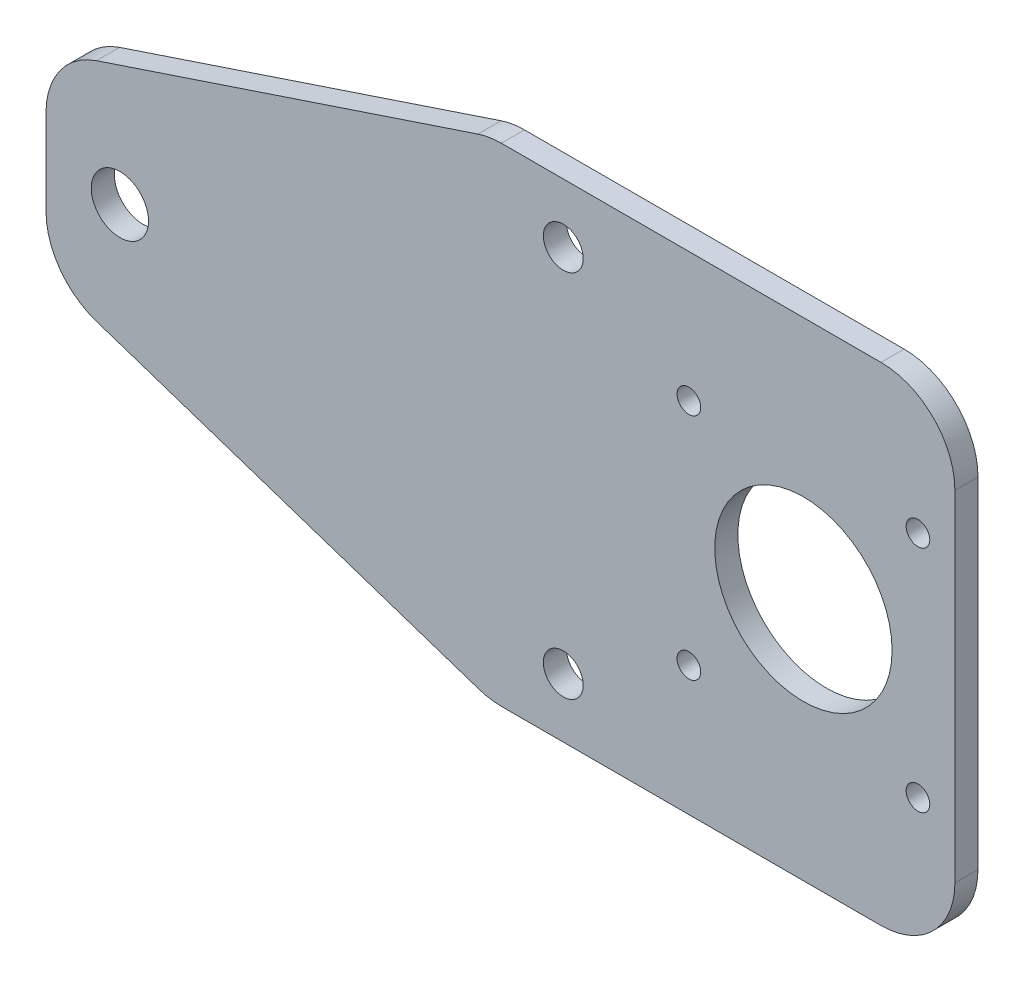
ISO-10303-21;
HEADER;
FILE_DESCRIPTION(('STEP AP214'),'2;1');
FILE_NAME('part.step','',(''),(''),'','','');
FILE_SCHEMA(('AUTOMOTIVE_DESIGN { 1 0 10303 214 1 1 1 1 }'));
ENDSEC;
DATA;
#1=APPLICATION_CONTEXT('core data for automotive mechanical design processes');
#2=APPLICATION_PROTOCOL_DEFINITION('international standard','automotive_design',2000,#1);
#3=PRODUCT_CONTEXT('',#1,'mechanical');
#4=PRODUCT('Part','Part','',(#3));
#5=PRODUCT_RELATED_PRODUCT_CATEGORY('part','',(#4));
#6=PRODUCT_DEFINITION_FORMATION('','',#4);
#7=PRODUCT_DEFINITION_CONTEXT('part definition',#1,'design');
#8=PRODUCT_DEFINITION('design','',#6,#7);
#9=PRODUCT_DEFINITION_SHAPE('','',#8);
#10=(LENGTH_UNIT() NAMED_UNIT(*) SI_UNIT(.MILLI.,.METRE.));
#11=(NAMED_UNIT(*) PLANE_ANGLE_UNIT() SI_UNIT($,.RADIAN.));
#12=(NAMED_UNIT(*) SI_UNIT($,.STERADIAN.) SOLID_ANGLE_UNIT());
#13=UNCERTAINTY_MEASURE_WITH_UNIT(LENGTH_MEASURE(1.E-05),#10,'distance_accuracy_value','');
#14=(GEOMETRIC_REPRESENTATION_CONTEXT(3) GLOBAL_UNCERTAINTY_ASSIGNED_CONTEXT((#13)) GLOBAL_UNIT_ASSIGNED_CONTEXT((#10,
#11,#12)) REPRESENTATION_CONTEXT('',''));
#15=CARTESIAN_POINT('',(0.,0.,0.));
#16=DIRECTION('',(0.,0.,1.));
#17=DIRECTION('',(1.,0.,0.));
#18=AXIS2_PLACEMENT_3D('',#15,#16,#17);
#19=CARTESIAN_POINT('',(0.,0.,3.125));
#20=DIRECTION('',(0.,0.,-1.));
#21=DIRECTION('',(-1.,0.,0.));
#22=AXIS2_PLACEMENT_3D('',#19,#20,#21);
#23=PLANE('',#22);
#24=CARTESIAN_POINT('',(86.9364751647332,17.5000000000003,3.125));
#25=DIRECTION('',(0.,0.,1.));
#26=DIRECTION('',(1.,0.,0.));
#27=AXIS2_PLACEMENT_3D('',#24,#25,#26);
#28=CIRCLE('',#27,1.59999999999999);
#29=CARTESIAN_POINT('',(88.5364751647331,17.5000000000003,3.125));
#30=VERTEX_POINT('',#29);
#31=EDGE_CURVE('E463',#30,#30,#28,.T.);
#32=ORIENTED_EDGE('',*,*,#31,.F.);
#33=EDGE_LOOP('',(#32));
#34=FACE_BOUND('',#33,.T.);
#35=CARTESIAN_POINT('',(86.9364751647332,48.5000000000002,3.125));
#36=DIRECTION('',(0.,0.,1.));
#37=DIRECTION('',(1.,0.,0.));
#38=AXIS2_PLACEMENT_3D('',#35,#36,#37);
#39=CIRCLE('',#38,1.59999999999999);
#40=CARTESIAN_POINT('',(88.5364751647332,48.5000000000002,3.125));
#41=VERTEX_POINT('',#40);
#42=EDGE_CURVE('E475',#41,#41,#39,.T.);
#43=ORIENTED_EDGE('',*,*,#42,.F.);
#44=EDGE_LOOP('',(#43));
#45=FACE_BOUND('',#44,.T.);
#46=CARTESIAN_POINT('',(69.9364751647331,58.0000000000003,3.125));
#47=DIRECTION('',(0.,0.,1.));
#48=DIRECTION('',(1.,0.,0.));
#49=AXIS2_PLACEMENT_3D('',#46,#47,#48);
#50=CIRCLE('',#49,2.7);
#51=CARTESIAN_POINT('',(72.6364751647331,58.0000000000003,3.125));
#52=VERTEX_POINT('',#51);
#53=EDGE_CURVE('E487',#52,#52,#50,.T.);
#54=ORIENTED_EDGE('',*,*,#53,.F.);
#55=EDGE_LOOP('',(#54));
#56=FACE_BOUND('',#55,.T.);
#57=CARTESIAN_POINT('',(69.9364751647331,8.00000000000026,3.125));
#58=DIRECTION('',(0.,0.,1.));
#59=DIRECTION('',(1.,0.,0.));
#60=AXIS2_PLACEMENT_3D('',#57,#58,#59);
#61=CIRCLE('',#60,2.7);
#62=CARTESIAN_POINT('',(72.6364751647331,8.00000000000026,3.125));
#63=VERTEX_POINT('',#62);
#64=EDGE_CURVE('E238',#63,#63,#61,.T.);
#65=ORIENTED_EDGE('',*,*,#64,.F.);
#66=EDGE_LOOP('',(#65));
#67=FACE_BOUND('',#66,.T.);
#68=DIRECTION('',(0.94878359624932,-0.315926712210614,0.));
#69=VECTOR('',#68,1.);
#70=CARTESIAN_POINT('',(-0.063524835266851,20.,3.125));
#71=LINE('',#70,#69);
#72=CARTESIAN_POINT('',(6.77720804262701,17.7221673564262,3.125));
#73=VERTEX_POINT('',#72);
#74=CARTESIAN_POINT('',(58.461881130674,0.512164037506802,3.125));
#75=VERTEX_POINT('',#74);
#76=EDGE_CURVE('E229',#73,#75,#71,.T.);
#77=ORIENTED_EDGE('',*,*,#76,.T.);
#78=CARTESIAN_POINT('',(61.6211482527801,10.,3.125));
#79=DIRECTION('',(0.,0.,-1.));
#80=DIRECTION('',(-1.,0.,0.));
#81=AXIS2_PLACEMENT_3D('',#78,#79,#80);
#82=CIRCLE('',#81,10.);
#83=CARTESIAN_POINT('',(61.6211482527801,0.,3.125));
#84=VERTEX_POINT('',#83);
#85=EDGE_CURVE('E184',#75,#84,#82,.F.);
#86=ORIENTED_EDGE('',*,*,#85,.T.);
#87=DIRECTION('',(1.,0.,0.));
#88=VECTOR('',#87,1.);
#89=CARTESIAN_POINT('',(122.936475164733,0.,3.125));
#90=LINE('',#89,#88);
#91=CARTESIAN_POINT('',(112.936475164733,0.,3.125));
#92=VERTEX_POINT('',#91);
#93=EDGE_CURVE('E143',#84,#92,#90,.T.);
#94=ORIENTED_EDGE('',*,*,#93,.T.);
#95=CARTESIAN_POINT('',(112.936475164733,10.,3.125));
#96=DIRECTION('',(0.,0.,-1.));
#97=DIRECTION('',(-1.,0.,0.));
#98=AXIS2_PLACEMENT_3D('',#95,#96,#97);
#99=CIRCLE('',#98,10.);
#100=CARTESIAN_POINT('',(122.936475164733,10.,3.125));
#101=VERTEX_POINT('',#100);
#102=EDGE_CURVE('E176',#92,#101,#99,.F.);
#103=ORIENTED_EDGE('',*,*,#102,.T.);
#104=DIRECTION('',(0.,1.,0.));
#105=VECTOR('',#104,1.);
#106=CARTESIAN_POINT('',(122.936475164733,66.,3.125));
#107=LINE('',#106,#105);
#108=CARTESIAN_POINT('',(122.936475164733,56.,3.125));
#109=VERTEX_POINT('',#108);
#110=EDGE_CURVE('E203',#101,#109,#107,.T.);
#111=ORIENTED_EDGE('',*,*,#110,.T.);
#112=CARTESIAN_POINT('',(112.936475164733,56.,3.125));
#113=DIRECTION('',(0.,0.,-1.));
#114=DIRECTION('',(-1.,0.,0.));
#115=AXIS2_PLACEMENT_3D('',#112,#113,#114);
#116=CIRCLE('',#115,10.);
#117=CARTESIAN_POINT('',(112.936475164733,66.,3.125));
#118=VERTEX_POINT('',#117);
#119=EDGE_CURVE('E54',#109,#118,#116,.F.);
#120=ORIENTED_EDGE('',*,*,#119,.T.);
#121=DIRECTION('',(-1.,0.,0.));
#122=VECTOR('',#121,1.);
#123=CARTESIAN_POINT('',(59.9364751647331,66.,3.125));
#124=LINE('',#123,#122);
#125=CARTESIAN_POINT('',(61.5592517664169,66.,3.125));
#126=VERTEX_POINT('',#125);
#127=EDGE_CURVE('E163',#118,#126,#124,.T.);
#128=ORIENTED_EDGE('',*,*,#127,.T.);
#129=CARTESIAN_POINT('',(61.5592517664169,56.,3.125));
#130=DIRECTION('',(0.,0.,-1.));
#131=DIRECTION('',(-1.,0.,0.));
#132=AXIS2_PLACEMENT_3D('',#129,#130,#131);
#133=CIRCLE('',#132,10.);
#134=CARTESIAN_POINT('',(58.3969741062485,65.4868329805051,3.125));
#135=VERTEX_POINT('',#134);
#136=EDGE_CURVE('E182',#126,#135,#133,.F.);
#137=ORIENTED_EDGE('',*,*,#136,.T.);
#138=DIRECTION('',(-0.948683298050514,-0.316227766016838,0.));
#139=VECTOR('',#138,1.);
#140=CARTESIAN_POINT('',(-0.0635248352668542,46.,3.125));
#141=LINE('',#140,#139);
#142=CARTESIAN_POINT('',(6.77419750456477,48.2792407799439,3.125));
#143=VERTEX_POINT('',#142);
#144=EDGE_CURVE('E162',#135,#143,#141,.T.);
#145=ORIENTED_EDGE('',*,*,#144,.T.);
#146=CARTESIAN_POINT('',(9.93647516473315,38.7924077994387,3.125));
#147=DIRECTION('',(0.,0.,-1.));
#148=DIRECTION('',(-1.,0.,0.));
#149=AXIS2_PLACEMENT_3D('',#146,#147,#148);
#150=CIRCLE('',#149,10.);
#151=CARTESIAN_POINT('',(-0.0635248352668533,38.7924077994387,3.125));
#152=VERTEX_POINT('',#151);
#153=EDGE_CURVE('E180',#143,#152,#150,.F.);
#154=ORIENTED_EDGE('',*,*,#153,.T.);
#155=DIRECTION('',(0.,-1.,0.));
#156=VECTOR('',#155,1.);
#157=CARTESIAN_POINT('',(-0.0635248352668542,46.,3.125));
#158=LINE('',#157,#156);
#159=CARTESIAN_POINT('',(-0.0635248352668519,27.2100033189194,3.125));
#160=VERTEX_POINT('',#159);
#161=EDGE_CURVE('E226',#152,#160,#158,.T.);
#162=ORIENTED_EDGE('',*,*,#161,.T.);
#163=CARTESIAN_POINT('',(9.93647516473315,27.2100033189194,3.125));
#164=DIRECTION('',(0.,0.,-1.));
#165=DIRECTION('',(-1.,0.,0.));
#166=AXIS2_PLACEMENT_3D('',#163,#164,#165);
#167=CIRCLE('',#166,10.);
#168=EDGE_CURVE('E178',#160,#73,#167,.F.);
#169=ORIENTED_EDGE('',*,*,#168,.T.);
#170=EDGE_LOOP('',(#77,#86,#94,#103,#111,#120,#128,#137,#145,#154,#162,#169));
#171=FACE_BOUND('',#170,.T.);
#172=CARTESIAN_POINT('',(9.93647516473315,33.0000000000003,3.125));
#173=DIRECTION('',(0.,0.,1.));
#174=DIRECTION('',(1.,0.,0.));
#175=AXIS2_PLACEMENT_3D('',#172,#173,#174);
#176=CIRCLE('',#175,3.87500000000001);
#177=CARTESIAN_POINT('',(13.8114751647332,33.0000000000003,3.125));
#178=VERTEX_POINT('',#177);
#179=EDGE_CURVE('E493',#178,#178,#176,.T.);
#180=ORIENTED_EDGE('',*,*,#179,.F.);
#181=EDGE_LOOP('',(#180));
#182=FACE_BOUND('',#181,.T.);
#183=CARTESIAN_POINT('',(102.436475164733,33.0000000000003,3.125));
#184=DIRECTION('',(0.,0.,1.));
#185=DIRECTION('',(1.,0.,0.));
#186=AXIS2_PLACEMENT_3D('',#183,#184,#185);
#187=CIRCLE('',#186,12.);
#188=CARTESIAN_POINT('',(114.436475164733,33.0000000000003,3.125));
#189=VERTEX_POINT('',#188);
#190=EDGE_CURVE('E481',#189,#189,#187,.T.);
#191=ORIENTED_EDGE('',*,*,#190,.F.);
#192=EDGE_LOOP('',(#191));
#193=FACE_BOUND('',#192,.T.);
#194=CARTESIAN_POINT('',(117.936475164733,48.5000000000001,3.125));
#195=DIRECTION('',(0.,0.,1.));
#196=DIRECTION('',(1.,0.,0.));
#197=AXIS2_PLACEMENT_3D('',#194,#195,#196);
#198=CIRCLE('',#197,1.59999999999999);
#199=CARTESIAN_POINT('',(119.536475164733,48.5000000000001,3.125));
#200=VERTEX_POINT('',#199);
#201=EDGE_CURVE('E469',#200,#200,#198,.T.);
#202=ORIENTED_EDGE('',*,*,#201,.F.);
#203=EDGE_LOOP('',(#202));
#204=FACE_BOUND('',#203,.T.);
#205=CARTESIAN_POINT('',(117.936475164733,17.5000000000003,3.125));
#206=DIRECTION('',(0.,0.,1.));
#207=DIRECTION('',(1.,0.,0.));
#208=AXIS2_PLACEMENT_3D('',#205,#206,#207);
#209=CIRCLE('',#208,1.59999999999999);
#210=CARTESIAN_POINT('',(119.536475164733,17.5000000000003,3.125));
#211=VERTEX_POINT('',#210);
#212=EDGE_CURVE('E454',#211,#211,#209,.T.);
#213=ORIENTED_EDGE('',*,*,#212,.F.);
#214=EDGE_LOOP('',(#213));
#215=FACE_BOUND('',#214,.T.);
#216=ADVANCED_FACE('F32',(#34,#45,#56,#67,#171,#182,#193,#204,#215),#23,.F.);
#217=CARTESIAN_POINT('',(0.,0.,0.));
#218=DIRECTION('',(0.,0.,-1.));
#219=DIRECTION('',(-1.,0.,0.));
#220=AXIS2_PLACEMENT_3D('',#217,#218,#219);
#221=PLANE('',#220);
#222=CARTESIAN_POINT('',(86.9364751647332,17.5000000000003,0.));
#223=DIRECTION('',(0.,0.,1.));
#224=DIRECTION('',(1.,0.,0.));
#225=AXIS2_PLACEMENT_3D('',#222,#223,#224);
#226=CIRCLE('',#225,1.59999999999999);
#227=CARTESIAN_POINT('',(88.5364751647331,17.5000000000003,0.));
#228=VERTEX_POINT('',#227);
#229=EDGE_CURVE('E460',#228,#228,#226,.T.);
#230=ORIENTED_EDGE('',*,*,#229,.T.);
#231=EDGE_LOOP('',(#230));
#232=FACE_BOUND('',#231,.T.);
#233=CARTESIAN_POINT('',(86.9364751647332,48.5000000000002,0.));
#234=DIRECTION('',(0.,0.,1.));
#235=DIRECTION('',(1.,0.,0.));
#236=AXIS2_PLACEMENT_3D('',#233,#234,#235);
#237=CIRCLE('',#236,1.59999999999999);
#238=CARTESIAN_POINT('',(88.5364751647332,48.5000000000002,0.));
#239=VERTEX_POINT('',#238);
#240=EDGE_CURVE('E472',#239,#239,#237,.T.);
#241=ORIENTED_EDGE('',*,*,#240,.T.);
#242=EDGE_LOOP('',(#241));
#243=FACE_BOUND('',#242,.T.);
#244=CARTESIAN_POINT('',(69.9364751647331,58.0000000000003,0.));
#245=DIRECTION('',(0.,0.,1.));
#246=DIRECTION('',(1.,0.,0.));
#247=AXIS2_PLACEMENT_3D('',#244,#245,#246);
#248=CIRCLE('',#247,2.7);
#249=CARTESIAN_POINT('',(72.6364751647331,58.0000000000003,0.));
#250=VERTEX_POINT('',#249);
#251=EDGE_CURVE('E484',#250,#250,#248,.T.);
#252=ORIENTED_EDGE('',*,*,#251,.T.);
#253=EDGE_LOOP('',(#252));
#254=FACE_BOUND('',#253,.T.);
#255=CARTESIAN_POINT('',(69.9364751647331,8.00000000000026,0.));
#256=DIRECTION('',(0.,0.,1.));
#257=DIRECTION('',(1.,0.,0.));
#258=AXIS2_PLACEMENT_3D('',#255,#256,#257);
#259=CIRCLE('',#258,2.7);
#260=CARTESIAN_POINT('',(72.6364751647331,8.00000000000026,0.));
#261=VERTEX_POINT('',#260);
#262=EDGE_CURVE('E232',#261,#261,#259,.T.);
#263=ORIENTED_EDGE('',*,*,#262,.T.);
#264=EDGE_LOOP('',(#263));
#265=FACE_BOUND('',#264,.T.);
#266=DIRECTION('',(1.,0.,0.));
#267=VECTOR('',#266,1.);
#268=CARTESIAN_POINT('',(122.936475164733,0.,0.));
#269=LINE('',#268,#267);
#270=CARTESIAN_POINT('',(61.6211482527801,0.,0.));
#271=VERTEX_POINT('',#270);
#272=CARTESIAN_POINT('',(112.936475164733,0.,0.));
#273=VERTEX_POINT('',#272);
#274=EDGE_CURVE('E140',#271,#273,#269,.T.);
#275=ORIENTED_EDGE('',*,*,#274,.F.);
#276=CARTESIAN_POINT('',(61.6211482527801,10.,0.));
#277=DIRECTION('',(0.,0.,-1.));
#278=DIRECTION('',(-1.,0.,0.));
#279=AXIS2_PLACEMENT_3D('',#276,#277,#278);
#280=CIRCLE('',#279,10.);
#281=CARTESIAN_POINT('',(58.461881130674,0.512164037506802,0.));
#282=VERTEX_POINT('',#281);
#283=EDGE_CURVE('E123',#271,#282,#280,.T.);
#284=ORIENTED_EDGE('',*,*,#283,.T.);
#285=DIRECTION('',(0.94878359624932,-0.315926712210614,0.));
#286=VECTOR('',#285,1.);
#287=CARTESIAN_POINT('',(-0.063524835266851,20.,0.));
#288=LINE('',#287,#286);
#289=CARTESIAN_POINT('',(6.77720804262701,17.7221673564262,0.));
#290=VERTEX_POINT('',#289);
#291=EDGE_CURVE('E152',#290,#282,#288,.T.);
#292=ORIENTED_EDGE('',*,*,#291,.F.);
#293=CARTESIAN_POINT('',(9.93647516473315,27.2100033189194,0.));
#294=DIRECTION('',(0.,0.,-1.));
#295=DIRECTION('',(-1.,0.,0.));
#296=AXIS2_PLACEMENT_3D('',#293,#294,#295);
#297=CIRCLE('',#296,10.);
#298=CARTESIAN_POINT('',(-0.0635248352668519,27.2100033189194,0.));
#299=VERTEX_POINT('',#298);
#300=EDGE_CURVE('E167',#290,#299,#297,.T.);
#301=ORIENTED_EDGE('',*,*,#300,.T.);
#302=DIRECTION('',(0.,-1.,0.));
#303=VECTOR('',#302,1.);
#304=CARTESIAN_POINT('',(-0.0635248352668542,46.,0.));
#305=LINE('',#304,#303);
#306=CARTESIAN_POINT('',(-0.0635248352668533,38.7924077994387,0.));
#307=VERTEX_POINT('',#306);
#308=EDGE_CURVE('E157',#307,#299,#305,.T.);
#309=ORIENTED_EDGE('',*,*,#308,.F.);
#310=CARTESIAN_POINT('',(9.93647516473315,38.7924077994387,0.));
#311=DIRECTION('',(0.,0.,-1.));
#312=DIRECTION('',(-1.,0.,0.));
#313=AXIS2_PLACEMENT_3D('',#310,#311,#312);
#314=CIRCLE('',#313,10.);
#315=CARTESIAN_POINT('',(6.77419750456477,48.2792407799439,0.));
#316=VERTEX_POINT('',#315);
#317=EDGE_CURVE('E169',#307,#316,#314,.T.);
#318=ORIENTED_EDGE('',*,*,#317,.T.);
#319=DIRECTION('',(-0.948683298050514,-0.316227766016838,0.));
#320=VECTOR('',#319,1.);
#321=CARTESIAN_POINT('',(-0.0635248352668542,46.,0.));
#322=LINE('',#321,#320);
#323=CARTESIAN_POINT('',(58.3969741062485,65.4868329805051,0.));
#324=VERTEX_POINT('',#323);
#325=EDGE_CURVE('E215',#324,#316,#322,.T.);
#326=ORIENTED_EDGE('',*,*,#325,.F.);
#327=CARTESIAN_POINT('',(61.5592517664169,56.,0.));
#328=DIRECTION('',(0.,0.,-1.));
#329=DIRECTION('',(-1.,0.,0.));
#330=AXIS2_PLACEMENT_3D('',#327,#328,#329);
#331=CIRCLE('',#330,10.);
#332=CARTESIAN_POINT('',(61.5592517664169,66.,0.));
#333=VERTEX_POINT('',#332);
#334=EDGE_CURVE('E134',#324,#333,#331,.T.);
#335=ORIENTED_EDGE('',*,*,#334,.T.);
#336=DIRECTION('',(-1.,0.,0.));
#337=VECTOR('',#336,1.);
#338=CARTESIAN_POINT('',(59.9364751647331,66.,0.));
#339=LINE('',#338,#337);
#340=CARTESIAN_POINT('',(112.936475164733,66.,0.));
#341=VERTEX_POINT('',#340);
#342=EDGE_CURVE('E155',#341,#333,#339,.T.);
#343=ORIENTED_EDGE('',*,*,#342,.F.);
#344=CARTESIAN_POINT('',(112.936475164733,56.,0.));
#345=DIRECTION('',(0.,0.,-1.));
#346=DIRECTION('',(-1.,0.,0.));
#347=AXIS2_PLACEMENT_3D('',#344,#345,#346);
#348=CIRCLE('',#347,10.);
#349=CARTESIAN_POINT('',(122.936475164733,56.,0.));
#350=VERTEX_POINT('',#349);
#351=EDGE_CURVE('E144',#341,#350,#348,.T.);
#352=ORIENTED_EDGE('',*,*,#351,.T.);
#353=DIRECTION('',(0.,1.,0.));
#354=VECTOR('',#353,1.);
#355=CARTESIAN_POINT('',(122.936475164733,66.,0.));
#356=LINE('',#355,#354);
#357=CARTESIAN_POINT('',(122.936475164733,10.,0.));
#358=VERTEX_POINT('',#357);
#359=EDGE_CURVE('E151',#358,#350,#356,.T.);
#360=ORIENTED_EDGE('',*,*,#359,.F.);
#361=CARTESIAN_POINT('',(112.936475164733,10.,0.));
#362=DIRECTION('',(0.,0.,-1.));
#363=DIRECTION('',(-1.,0.,0.));
#364=AXIS2_PLACEMENT_3D('',#361,#362,#363);
#365=CIRCLE('',#364,10.);
#366=EDGE_CURVE('E150',#358,#273,#365,.T.);
#367=ORIENTED_EDGE('',*,*,#366,.T.);
#368=EDGE_LOOP('',(#275,#284,#292,#301,#309,#318,#326,#335,#343,#352,#360,#367));
#369=FACE_BOUND('',#368,.T.);
#370=CARTESIAN_POINT('',(9.93647516473315,33.0000000000003,0.));
#371=DIRECTION('',(0.,0.,1.));
#372=DIRECTION('',(1.,0.,0.));
#373=AXIS2_PLACEMENT_3D('',#370,#371,#372);
#374=CIRCLE('',#373,3.87500000000001);
#375=CARTESIAN_POINT('',(13.8114751647332,33.0000000000003,0.));
#376=VERTEX_POINT('',#375);
#377=EDGE_CURVE('E490',#376,#376,#374,.T.);
#378=ORIENTED_EDGE('',*,*,#377,.T.);
#379=EDGE_LOOP('',(#378));
#380=FACE_BOUND('',#379,.T.);
#381=CARTESIAN_POINT('',(102.436475164733,33.0000000000003,0.));
#382=DIRECTION('',(0.,0.,1.));
#383=DIRECTION('',(1.,0.,0.));
#384=AXIS2_PLACEMENT_3D('',#381,#382,#383);
#385=CIRCLE('',#384,12.);
#386=CARTESIAN_POINT('',(114.436475164733,33.0000000000003,0.));
#387=VERTEX_POINT('',#386);
#388=EDGE_CURVE('E478',#387,#387,#385,.T.);
#389=ORIENTED_EDGE('',*,*,#388,.T.);
#390=EDGE_LOOP('',(#389));
#391=FACE_BOUND('',#390,.T.);
#392=CARTESIAN_POINT('',(117.936475164733,48.5000000000001,0.));
#393=DIRECTION('',(0.,0.,1.));
#394=DIRECTION('',(1.,0.,0.));
#395=AXIS2_PLACEMENT_3D('',#392,#393,#394);
#396=CIRCLE('',#395,1.59999999999999);
#397=CARTESIAN_POINT('',(119.536475164733,48.5000000000001,0.));
#398=VERTEX_POINT('',#397);
#399=EDGE_CURVE('E466',#398,#398,#396,.T.);
#400=ORIENTED_EDGE('',*,*,#399,.T.);
#401=EDGE_LOOP('',(#400));
#402=FACE_BOUND('',#401,.T.);
#403=CARTESIAN_POINT('',(117.936475164733,17.5000000000003,0.));
#404=DIRECTION('',(0.,0.,1.));
#405=DIRECTION('',(1.,0.,0.));
#406=AXIS2_PLACEMENT_3D('',#403,#404,#405);
#407=CIRCLE('',#406,1.59999999999999);
#408=CARTESIAN_POINT('',(119.536475164733,17.5000000000003,0.));
#409=VERTEX_POINT('',#408);
#410=EDGE_CURVE('E457',#409,#409,#407,.T.);
#411=ORIENTED_EDGE('',*,*,#410,.T.);
#412=EDGE_LOOP('',(#411));
#413=FACE_BOUND('',#412,.T.);
#414=ADVANCED_FACE('F147',(#232,#243,#254,#265,#369,#380,#391,#402,#413),#221,.T.);
#415=CARTESIAN_POINT('',(-0.0635248352668542,46.,3.125));
#416=DIRECTION('',(0.316227766016838,-0.948683298050514,0.));
#417=DIRECTION('',(0.948683298050514,0.316227766016838,0.));
#418=AXIS2_PLACEMENT_3D('',#415,#416,#417);
#419=PLANE('',#418);
#420=ORIENTED_EDGE('',*,*,#144,.F.);
#421=DIRECTION('',(0.,0.,-1.));
#422=VECTOR('',#421,1.);
#423=CARTESIAN_POINT('',(58.3969741062485,65.4868329805051,3.125));
#424=LINE('',#423,#422);
#425=EDGE_CURVE('E188',#135,#324,#424,.T.);
#426=ORIENTED_EDGE('',*,*,#425,.T.);
#427=ORIENTED_EDGE('',*,*,#325,.T.);
#428=DIRECTION('',(0.,0.,-1.));
#429=VECTOR('',#428,1.);
#430=CARTESIAN_POINT('',(6.77419750456477,48.2792407799439,3.125));
#431=LINE('',#430,#429);
#432=EDGE_CURVE('E186',#316,#143,#431,.F.);
#433=ORIENTED_EDGE('',*,*,#432,.T.);
#434=EDGE_LOOP('',(#420,#426,#427,#433));
#435=FACE_BOUND('',#434,.T.);
#436=ADVANCED_FACE('F222',(#435),#419,.F.);
#437=CARTESIAN_POINT('',(-0.0635248352668542,46.,3.125));
#438=DIRECTION('',(1.,0.,0.));
#439=DIRECTION('',(0.,1.,0.));
#440=AXIS2_PLACEMENT_3D('',#437,#438,#439);
#441=PLANE('',#440);
#442=ORIENTED_EDGE('',*,*,#161,.F.);
#443=DIRECTION('',(0.,0.,-1.));
#444=VECTOR('',#443,1.);
#445=CARTESIAN_POINT('',(-0.0635248352668533,38.7924077994387,3.125));
#446=LINE('',#445,#444);
#447=EDGE_CURVE('E197',#152,#307,#446,.T.);
#448=ORIENTED_EDGE('',*,*,#447,.T.);
#449=ORIENTED_EDGE('',*,*,#308,.T.);
#450=DIRECTION('',(0.,0.,-1.));
#451=VECTOR('',#450,1.);
#452=CARTESIAN_POINT('',(-0.0635248352668519,27.2100033189194,3.125));
#453=LINE('',#452,#451);
#454=EDGE_CURVE('E195',#299,#160,#453,.F.);
#455=ORIENTED_EDGE('',*,*,#454,.T.);
#456=EDGE_LOOP('',(#442,#448,#449,#455));
#457=FACE_BOUND('',#456,.T.);
#458=ADVANCED_FACE('F244',(#457),#441,.F.);
#459=CARTESIAN_POINT('',(-0.063524835266851,20.,3.125));
#460=DIRECTION('',(0.315926712210614,0.94878359624932,0.));
#461=DIRECTION('',(-0.94878359624932,0.315926712210614,0.));
#462=AXIS2_PLACEMENT_3D('',#459,#460,#461);
#463=PLANE('',#462);
#464=ORIENTED_EDGE('',*,*,#291,.T.);
#465=DIRECTION('',(0.,0.,-1.));
#466=VECTOR('',#465,1.);
#467=CARTESIAN_POINT('',(58.461881130674,0.512164037506806,3.125));
#468=LINE('',#467,#466);
#469=EDGE_CURVE('E128',#282,#75,#468,.F.);
#470=ORIENTED_EDGE('',*,*,#469,.T.);
#471=ORIENTED_EDGE('',*,*,#76,.F.);
#472=DIRECTION('',(0.,0.,-1.));
#473=VECTOR('',#472,1.);
#474=CARTESIAN_POINT('',(6.77720804262701,17.7221673564262,3.125));
#475=LINE('',#474,#473);
#476=EDGE_CURVE('E133',#73,#290,#475,.T.);
#477=ORIENTED_EDGE('',*,*,#476,.T.);
#478=EDGE_LOOP('',(#464,#470,#471,#477));
#479=FACE_BOUND('',#478,.T.);
#480=ADVANCED_FACE('F252',(#479),#463,.F.);
#481=CARTESIAN_POINT('',(122.936475164733,0.,3.125));
#482=DIRECTION('',(0.,1.,0.));
#483=DIRECTION('',(-1.,0.,0.));
#484=AXIS2_PLACEMENT_3D('',#481,#482,#483);
#485=PLANE('',#484);
#486=ORIENTED_EDGE('',*,*,#93,.F.);
#487=DIRECTION('',(0.,0.,-1.));
#488=VECTOR('',#487,1.);
#489=CARTESIAN_POINT('',(61.6211482527801,0.,3.125));
#490=LINE('',#489,#488);
#491=EDGE_CURVE('E127',#84,#271,#490,.T.);
#492=ORIENTED_EDGE('',*,*,#491,.T.);
#493=ORIENTED_EDGE('',*,*,#274,.T.);
#494=DIRECTION('',(0.,0.,-1.));
#495=VECTOR('',#494,1.);
#496=CARTESIAN_POINT('',(112.936475164733,0.,3.125));
#497=LINE('',#496,#495);
#498=EDGE_CURVE('E145',#273,#92,#497,.F.);
#499=ORIENTED_EDGE('',*,*,#498,.T.);
#500=EDGE_LOOP('',(#486,#492,#493,#499));
#501=FACE_BOUND('',#500,.T.);
#502=ADVANCED_FACE('F139',(#501),#485,.F.);
#503=CARTESIAN_POINT('',(122.936475164733,66.,3.125));
#504=DIRECTION('',(-1.,0.,0.));
#505=DIRECTION('',(0.,-1.,0.));
#506=AXIS2_PLACEMENT_3D('',#503,#504,#505);
#507=PLANE('',#506);
#508=ORIENTED_EDGE('',*,*,#110,.F.);
#509=DIRECTION('',(0.,0.,-1.));
#510=VECTOR('',#509,1.);
#511=CARTESIAN_POINT('',(122.936475164733,10.,3.125));
#512=LINE('',#511,#510);
#513=EDGE_CURVE('E11',#101,#358,#512,.T.);
#514=ORIENTED_EDGE('',*,*,#513,.T.);
#515=ORIENTED_EDGE('',*,*,#359,.T.);
#516=DIRECTION('',(0.,0.,-1.));
#517=VECTOR('',#516,1.);
#518=CARTESIAN_POINT('',(122.936475164733,56.,3.125));
#519=LINE('',#518,#517);
#520=EDGE_CURVE('E40',#350,#109,#519,.F.);
#521=ORIENTED_EDGE('',*,*,#520,.T.);
#522=EDGE_LOOP('',(#508,#514,#515,#521));
#523=FACE_BOUND('',#522,.T.);
#524=ADVANCED_FACE('F202',(#523),#507,.F.);
#525=CARTESIAN_POINT('',(59.9364751647331,66.,3.125));
#526=DIRECTION('',(0.,-1.,0.));
#527=DIRECTION('',(0.,0.,-1.));
#528=AXIS2_PLACEMENT_3D('',#525,#526,#527);
#529=PLANE('',#528);
#530=ORIENTED_EDGE('',*,*,#342,.T.);
#531=DIRECTION('',(0.,0.,-1.));
#532=VECTOR('',#531,1.);
#533=CARTESIAN_POINT('',(61.5592517664169,66.,3.125));
#534=LINE('',#533,#532);
#535=EDGE_CURVE('E47',#333,#126,#534,.F.);
#536=ORIENTED_EDGE('',*,*,#535,.T.);
#537=ORIENTED_EDGE('',*,*,#127,.F.);
#538=DIRECTION('',(0.,0.,-1.));
#539=VECTOR('',#538,1.);
#540=CARTESIAN_POINT('',(112.936475164733,66.,3.125));
#541=LINE('',#540,#539);
#542=EDGE_CURVE('E191',#118,#341,#541,.T.);
#543=ORIENTED_EDGE('',*,*,#542,.T.);
#544=EDGE_LOOP('',(#530,#536,#537,#543));
#545=FACE_BOUND('',#544,.T.);
#546=ADVANCED_FACE('F212',(#545),#529,.F.);
#547=CARTESIAN_POINT('',(69.9364751647331,8.00000000000026,3.125));
#548=DIRECTION('',(0.,0.,-1.));
#549=DIRECTION('',(-1.,0.,0.));
#550=AXIS2_PLACEMENT_3D('',#547,#548,#549);
#551=CYLINDRICAL_SURFACE('',#550,2.7);
#552=ORIENTED_EDGE('',*,*,#64,.T.);
#553=EDGE_LOOP('',(#552));
#554=FACE_BOUND('',#553,.T.);
#555=ORIENTED_EDGE('',*,*,#262,.F.);
#556=EDGE_LOOP('',(#555));
#557=FACE_BOUND('',#556,.T.);
#558=ADVANCED_FACE('F272',(#554,#557),#551,.F.);
#559=CARTESIAN_POINT('',(9.93647516473315,33.0000000000003,3.125));
#560=DIRECTION('',(0.,0.,-1.));
#561=DIRECTION('',(-1.,0.,0.));
#562=AXIS2_PLACEMENT_3D('',#559,#560,#561);
#563=CYLINDRICAL_SURFACE('',#562,3.87500000000001);
#564=ORIENTED_EDGE('',*,*,#179,.T.);
#565=EDGE_LOOP('',(#564));
#566=FACE_BOUND('',#565,.T.);
#567=ORIENTED_EDGE('',*,*,#377,.F.);
#568=EDGE_LOOP('',(#567));
#569=FACE_BOUND('',#568,.T.);
#570=ADVANCED_FACE('F293',(#566,#569),#563,.F.);
#571=CARTESIAN_POINT('',(69.9364751647331,58.0000000000003,3.125));
#572=DIRECTION('',(0.,0.,-1.));
#573=DIRECTION('',(-1.,0.,0.));
#574=AXIS2_PLACEMENT_3D('',#571,#572,#573);
#575=CYLINDRICAL_SURFACE('',#574,2.7);
#576=ORIENTED_EDGE('',*,*,#53,.T.);
#577=EDGE_LOOP('',(#576));
#578=FACE_BOUND('',#577,.T.);
#579=ORIENTED_EDGE('',*,*,#251,.F.);
#580=EDGE_LOOP('',(#579));
#581=FACE_BOUND('',#580,.T.);
#582=ADVANCED_FACE('F300',(#578,#581),#575,.F.);
#583=CARTESIAN_POINT('',(102.436475164733,33.0000000000003,3.125));
#584=DIRECTION('',(0.,0.,-1.));
#585=DIRECTION('',(-1.,0.,0.));
#586=AXIS2_PLACEMENT_3D('',#583,#584,#585);
#587=CYLINDRICAL_SURFACE('',#586,12.);
#588=ORIENTED_EDGE('',*,*,#190,.T.);
#589=EDGE_LOOP('',(#588));
#590=FACE_BOUND('',#589,.T.);
#591=ORIENTED_EDGE('',*,*,#388,.F.);
#592=EDGE_LOOP('',(#591));
#593=FACE_BOUND('',#592,.T.);
#594=ADVANCED_FACE('F307',(#590,#593),#587,.F.);
#595=CARTESIAN_POINT('',(86.9364751647332,48.5000000000002,3.125));
#596=DIRECTION('',(0.,0.,-1.));
#597=DIRECTION('',(-1.,0.,0.));
#598=AXIS2_PLACEMENT_3D('',#595,#596,#597);
#599=CYLINDRICAL_SURFACE('',#598,1.59999999999999);
#600=ORIENTED_EDGE('',*,*,#42,.T.);
#601=EDGE_LOOP('',(#600));
#602=FACE_BOUND('',#601,.T.);
#603=ORIENTED_EDGE('',*,*,#240,.F.);
#604=EDGE_LOOP('',(#603));
#605=FACE_BOUND('',#604,.T.);
#606=ADVANCED_FACE('F315',(#602,#605),#599,.F.);
#607=CARTESIAN_POINT('',(117.936475164733,48.5000000000001,3.125));
#608=DIRECTION('',(0.,0.,-1.));
#609=DIRECTION('',(-1.,0.,0.));
#610=AXIS2_PLACEMENT_3D('',#607,#608,#609);
#611=CYLINDRICAL_SURFACE('',#610,1.59999999999999);
#612=ORIENTED_EDGE('',*,*,#201,.T.);
#613=EDGE_LOOP('',(#612));
#614=FACE_BOUND('',#613,.T.);
#615=ORIENTED_EDGE('',*,*,#399,.F.);
#616=EDGE_LOOP('',(#615));
#617=FACE_BOUND('',#616,.T.);
#618=ADVANCED_FACE('F323',(#614,#617),#611,.F.);
#619=CARTESIAN_POINT('',(86.9364751647332,17.5000000000003,3.125));
#620=DIRECTION('',(0.,0.,-1.));
#621=DIRECTION('',(-1.,0.,0.));
#622=AXIS2_PLACEMENT_3D('',#619,#620,#621);
#623=CYLINDRICAL_SURFACE('',#622,1.59999999999999);
#624=ORIENTED_EDGE('',*,*,#31,.T.);
#625=EDGE_LOOP('',(#624));
#626=FACE_BOUND('',#625,.T.);
#627=ORIENTED_EDGE('',*,*,#229,.F.);
#628=EDGE_LOOP('',(#627));
#629=FACE_BOUND('',#628,.T.);
#630=ADVANCED_FACE('F331',(#626,#629),#623,.F.);
#631=CARTESIAN_POINT('',(117.936475164733,17.5000000000003,3.125));
#632=DIRECTION('',(0.,0.,-1.));
#633=DIRECTION('',(-1.,0.,0.));
#634=AXIS2_PLACEMENT_3D('',#631,#632,#633);
#635=CYLINDRICAL_SURFACE('',#634,1.59999999999999);
#636=ORIENTED_EDGE('',*,*,#212,.T.);
#637=EDGE_LOOP('',(#636));
#638=FACE_BOUND('',#637,.T.);
#639=ORIENTED_EDGE('',*,*,#410,.F.);
#640=EDGE_LOOP('',(#639));
#641=FACE_BOUND('',#640,.T.);
#642=ADVANCED_FACE('F339',(#638,#641),#635,.F.);
#643=CARTESIAN_POINT('',(61.6211482527801,10.,3.125));
#644=DIRECTION('',(0.,0.,-1.));
#645=DIRECTION('',(-1.,0.,0.));
#646=AXIS2_PLACEMENT_3D('',#643,#644,#645);
#647=CYLINDRICAL_SURFACE('',#646,10.);
#648=ORIENTED_EDGE('',*,*,#85,.F.);
#649=ORIENTED_EDGE('',*,*,#469,.F.);
#650=ORIENTED_EDGE('',*,*,#283,.F.);
#651=ORIENTED_EDGE('',*,*,#491,.F.);
#652=EDGE_LOOP('',(#648,#649,#650,#651));
#653=FACE_BOUND('',#652,.T.);
#654=ADVANCED_FACE('F126',(#653),#647,.T.);
#655=CARTESIAN_POINT('',(61.5592517664169,56.,3.125));
#656=DIRECTION('',(0.,0.,-1.));
#657=DIRECTION('',(-1.,0.,0.));
#658=AXIS2_PLACEMENT_3D('',#655,#656,#657);
#659=CYLINDRICAL_SURFACE('',#658,10.);
#660=ORIENTED_EDGE('',*,*,#136,.F.);
#661=ORIENTED_EDGE('',*,*,#535,.F.);
#662=ORIENTED_EDGE('',*,*,#334,.F.);
#663=ORIENTED_EDGE('',*,*,#425,.F.);
#664=EDGE_LOOP('',(#660,#661,#662,#663));
#665=FACE_BOUND('',#664,.T.);
#666=ADVANCED_FACE('F219',(#665),#659,.T.);
#667=CARTESIAN_POINT('',(9.93647516473315,38.7924077994387,3.125));
#668=DIRECTION('',(0.,0.,-1.));
#669=DIRECTION('',(-1.,0.,0.));
#670=AXIS2_PLACEMENT_3D('',#667,#668,#669);
#671=CYLINDRICAL_SURFACE('',#670,10.);
#672=ORIENTED_EDGE('',*,*,#153,.F.);
#673=ORIENTED_EDGE('',*,*,#432,.F.);
#674=ORIENTED_EDGE('',*,*,#317,.F.);
#675=ORIENTED_EDGE('',*,*,#447,.F.);
#676=EDGE_LOOP('',(#672,#673,#674,#675));
#677=FACE_BOUND('',#676,.T.);
#678=ADVANCED_FACE('F359',(#677),#671,.T.);
#679=CARTESIAN_POINT('',(9.93647516473315,27.2100033189194,3.125));
#680=DIRECTION('',(0.,0.,-1.));
#681=DIRECTION('',(-1.,0.,0.));
#682=AXIS2_PLACEMENT_3D('',#679,#680,#681);
#683=CYLINDRICAL_SURFACE('',#682,10.);
#684=ORIENTED_EDGE('',*,*,#168,.F.);
#685=ORIENTED_EDGE('',*,*,#454,.F.);
#686=ORIENTED_EDGE('',*,*,#300,.F.);
#687=ORIENTED_EDGE('',*,*,#476,.F.);
#688=EDGE_LOOP('',(#684,#685,#686,#687));
#689=FACE_BOUND('',#688,.T.);
#690=ADVANCED_FACE('F248',(#689),#683,.T.);
#691=CARTESIAN_POINT('',(112.936475164733,10.,3.125));
#692=DIRECTION('',(0.,0.,-1.));
#693=DIRECTION('',(-1.,0.,0.));
#694=AXIS2_PLACEMENT_3D('',#691,#692,#693);
#695=CYLINDRICAL_SURFACE('',#694,10.);
#696=ORIENTED_EDGE('',*,*,#102,.F.);
#697=ORIENTED_EDGE('',*,*,#498,.F.);
#698=ORIENTED_EDGE('',*,*,#366,.F.);
#699=ORIENTED_EDGE('',*,*,#513,.F.);
#700=EDGE_LOOP('',(#696,#697,#698,#699));
#701=FACE_BOUND('',#700,.T.);
#702=ADVANCED_FACE('F373',(#701),#695,.T.);
#703=CARTESIAN_POINT('',(112.936475164733,56.,3.125));
#704=DIRECTION('',(0.,0.,-1.));
#705=DIRECTION('',(-1.,0.,0.));
#706=AXIS2_PLACEMENT_3D('',#703,#704,#705);
#707=CYLINDRICAL_SURFACE('',#706,10.);
#708=ORIENTED_EDGE('',*,*,#119,.F.);
#709=ORIENTED_EDGE('',*,*,#520,.F.);
#710=ORIENTED_EDGE('',*,*,#351,.F.);
#711=ORIENTED_EDGE('',*,*,#542,.F.);
#712=EDGE_LOOP('',(#708,#709,#710,#711));
#713=FACE_BOUND('',#712,.T.);
#714=ADVANCED_FACE('F34',(#713),#707,.T.);
#715=CLOSED_SHELL('',(#216,#414,#436,#458,#480,#502,#524,#546,#558,#570,#582,#594,#606,#618,
#630,#642,#654,#666,#678,#690,#702,#714));
#716=MANIFOLD_SOLID_BREP('B2',#715);
#717=ADVANCED_BREP_SHAPE_REPRESENTATION('',(#18,#716),#14);
#718=SHAPE_DEFINITION_REPRESENTATION(#9,#717);
ENDSEC;
END-ISO-10303-21;
